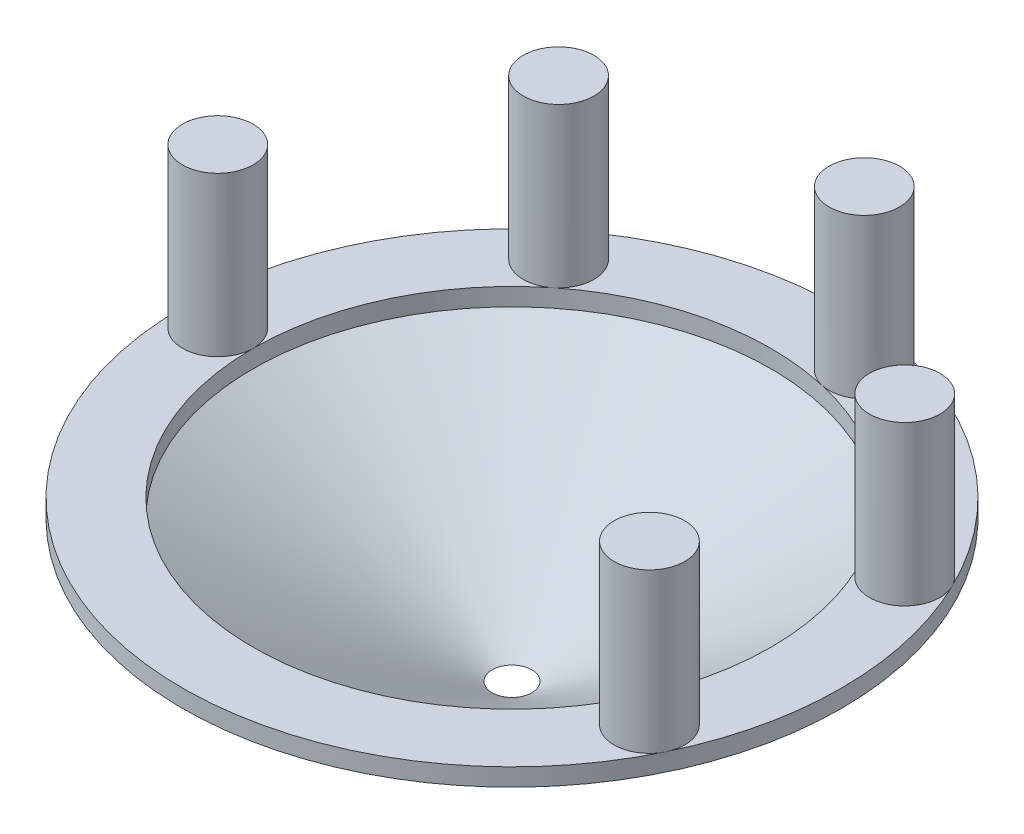
ISO-10303-21;
HEADER;
FILE_DESCRIPTION(('STEP AP214'),'2;1');
FILE_NAME('part.step','',(''),(''),'','','');
FILE_SCHEMA(('AUTOMOTIVE_DESIGN { 1 0 10303 214 1 1 1 1 }'));
ENDSEC;
DATA;
#1=APPLICATION_CONTEXT('core data for automotive mechanical design processes');
#2=APPLICATION_PROTOCOL_DEFINITION('international standard','automotive_design',2000,#1);
#3=PRODUCT_CONTEXT('',#1,'mechanical');
#4=PRODUCT('Part','Part','',(#3));
#5=PRODUCT_RELATED_PRODUCT_CATEGORY('part','',(#4));
#6=PRODUCT_DEFINITION_FORMATION('','',#4);
#7=PRODUCT_DEFINITION_CONTEXT('part definition',#1,'design');
#8=PRODUCT_DEFINITION('design','',#6,#7);
#9=PRODUCT_DEFINITION_SHAPE('','',#8);
#10=(LENGTH_UNIT() NAMED_UNIT(*) SI_UNIT(.MILLI.,.METRE.));
#11=(NAMED_UNIT(*) PLANE_ANGLE_UNIT() SI_UNIT($,.RADIAN.));
#12=(NAMED_UNIT(*) SI_UNIT($,.STERADIAN.) SOLID_ANGLE_UNIT());
#13=UNCERTAINTY_MEASURE_WITH_UNIT(LENGTH_MEASURE(1.E-05),#10,'distance_accuracy_value','');
#14=(GEOMETRIC_REPRESENTATION_CONTEXT(3) GLOBAL_UNCERTAINTY_ASSIGNED_CONTEXT((#13)) GLOBAL_UNIT_ASSIGNED_CONTEXT((#10,
#11,#12)) REPRESENTATION_CONTEXT('',''));
#15=CARTESIAN_POINT('',(0.,0.,0.));
#16=DIRECTION('',(0.,0.,1.));
#17=DIRECTION('',(1.,0.,0.));
#18=AXIS2_PLACEMENT_3D('',#15,#16,#17);
#19=CARTESIAN_POINT('',(22.,1.49999999999999,0.));
#20=DIRECTION('',(0.,1.,0.));
#21=DIRECTION('',(-1.,0.,0.));
#22=AXIS2_PLACEMENT_3D('',#19,#20,#21);
#23=PLANE('',#22);
#24=CARTESIAN_POINT('',(0.,1.49999999999995,0.));
#25=DIRECTION('',(0.,-1.,0.));
#26=DIRECTION('',(1.,0.,0.));
#27=AXIS2_PLACEMENT_3D('',#24,#25,#26);
#28=CIRCLE('',#27,22.);
#29=CARTESIAN_POINT('',(19.8213150938533,1.49999999999999,-9.54544226058617));
#30=VERTEX_POINT('',#29);
#31=CARTESIAN_POINT('',(19.8213150938531,1.50000000000001,9.54544226058644));
#32=VERTEX_POINT('',#31);
#33=EDGE_CURVE('E99',#30,#32,#28,.T.);
#34=ORIENTED_EDGE('',*,*,#33,.T.);
#35=CARTESIAN_POINT('',(22.5242216975604,1.49999999999999,10.8470934779391));
#36=DIRECTION('',(0.,1.,0.));
#37=DIRECTION('',(0.900968867902416,0.,0.433883739117565));
#38=AXIS2_PLACEMENT_3D('',#35,#36,#37);
#39=CIRCLE('',#38,3.);
#40=CARTESIAN_POINT('',(25.2271283012676,1.5,12.1487446952918));
#41=VERTEX_POINT('',#40);
#42=EDGE_CURVE('E54',#32,#41,#39,.F.);
#43=ORIENTED_EDGE('',*,*,#42,.T.);
#44=CARTESIAN_POINT('',(0.,1.49999999999995,0.));
#45=DIRECTION('',(0.,-1.,0.));
#46=DIRECTION('',(1.,0.,0.));
#47=AXIS2_PLACEMENT_3D('',#44,#45,#46);
#48=CIRCLE('',#47,28.);
#49=CARTESIAN_POINT('',(25.2271283012678,1.50000000000003,-12.1487446952915));
#50=VERTEX_POINT('',#49);
#51=EDGE_CURVE('E96',#50,#41,#48,.T.);
#52=ORIENTED_EDGE('',*,*,#51,.F.);
#53=CARTESIAN_POINT('',(22.5242216975605,1.49999999999999,-10.8470934779388));
#54=DIRECTION('',(0.,1.,0.));
#55=DIRECTION('',(0.900968867902422,0.,-0.433883739117553));
#56=AXIS2_PLACEMENT_3D('',#53,#54,#55);
#57=CIRCLE('',#56,3.);
#58=EDGE_CURVE('E61',#50,#30,#57,.F.);
#59=ORIENTED_EDGE('',*,*,#58,.T.);
#60=EDGE_LOOP('',(#34,#43,#52,#59));
#61=FACE_BOUND('',#60,.T.);
#62=ADVANCED_FACE('F39',(#61),#23,.T.);
#63=CARTESIAN_POINT('',(-28.,1.49999999999985,0.));
#64=VERTEX_POINT('',#63);
#65=EDGE_CURVE('E101',#41,#64,#48,.T.);
#66=ORIENTED_EDGE('',*,*,#65,.F.);
#67=EDGE_CURVE('E84',#41,#32,#39,.F.);
#68=ORIENTED_EDGE('',*,*,#67,.T.);
#69=CARTESIAN_POINT('',(-22.,1.49999999999985,0.));
#70=VERTEX_POINT('',#69);
#71=EDGE_CURVE('E48',#32,#70,#28,.T.);
#72=ORIENTED_EDGE('',*,*,#71,.T.);
#73=CARTESIAN_POINT('',(-25.,1.49999999999983,0.));
#74=DIRECTION('',(0.,1.,0.));
#75=DIRECTION('',(-1.,0.,0.));
#76=AXIS2_PLACEMENT_3D('',#73,#74,#75);
#77=CIRCLE('',#76,3.);
#78=EDGE_CURVE('E104',#70,#64,#77,.F.);
#79=ORIENTED_EDGE('',*,*,#78,.T.);
#80=EDGE_LOOP('',(#66,#68,#72,#79));
#81=FACE_BOUND('',#80,.T.);
#82=ADVANCED_FACE('F102',(#81),#23,.T.);
#83=CARTESIAN_POINT('',(4.89546054703897,1.49999999999993,-21.4484140680001));
#84=VERTEX_POINT('',#83);
#85=EDGE_CURVE('E159',#84,#30,#28,.T.);
#86=ORIENTED_EDGE('',*,*,#85,.T.);
#87=EDGE_CURVE('E151',#30,#50,#57,.F.);
#88=ORIENTED_EDGE('',*,*,#87,.T.);
#89=CARTESIAN_POINT('',(6.2305861507769,1.49999999999997,-27.297981541091));
#90=VERTEX_POINT('',#89);
#91=EDGE_CURVE('E114',#90,#50,#48,.T.);
#92=ORIENTED_EDGE('',*,*,#91,.F.);
#93=CARTESIAN_POINT('',(5.56302334890795,1.49999999999994,-24.3731978045456));
#94=DIRECTION('',(0.,1.,0.));
#95=DIRECTION('',(0.222520933956318,0.,-0.974927912181823));
#96=AXIS2_PLACEMENT_3D('',#93,#94,#95);
#97=CIRCLE('',#96,3.);
#98=EDGE_CURVE('E143',#90,#84,#97,.F.);
#99=ORIENTED_EDGE('',*,*,#98,.T.);
#100=EDGE_LOOP('',(#86,#88,#92,#99));
#101=FACE_BOUND('',#100,.T.);
#102=ADVANCED_FACE('F157',(#101),#23,.T.);
#103=CARTESIAN_POINT('',(-13.7167756408921,1.49999999999987,-17.2002926142967));
#104=VERTEX_POINT('',#103);
#105=EDGE_CURVE('E47',#104,#84,#28,.T.);
#106=ORIENTED_EDGE('',*,*,#105,.T.);
#107=EDGE_CURVE('E146',#84,#90,#97,.F.);
#108=ORIENTED_EDGE('',*,*,#107,.T.);
#109=CARTESIAN_POINT('',(-17.4577144520445,1.49999999999989,-21.8912815091049));
#110=VERTEX_POINT('',#109);
#111=EDGE_CURVE('E115',#110,#90,#48,.T.);
#112=ORIENTED_EDGE('',*,*,#111,.F.);
#113=CARTESIAN_POINT('',(-15.5872450464683,1.49999999999986,-19.5457870617008));
#114=DIRECTION('',(0.,1.,0.));
#115=DIRECTION('',(-0.623489801858732,0.,-0.781831482468031));
#116=AXIS2_PLACEMENT_3D('',#113,#114,#115);
#117=CIRCLE('',#116,3.);
#118=EDGE_CURVE('E136',#110,#104,#117,.F.);
#119=ORIENTED_EDGE('',*,*,#118,.T.);
#120=EDGE_LOOP('',(#106,#108,#112,#119));
#121=FACE_BOUND('',#120,.T.);
#122=ADVANCED_FACE('F175',(#121),#23,.T.);
#123=CARTESIAN_POINT('',(1.99793740244693E-12,-582.446756225542,0.));
#124=DIRECTION('',(0.,-1.,0.));
#125=DIRECTION('',(1.,0.,0.));
#126=AXIS2_PLACEMENT_3D('',#123,#124,#125);
#127=CYLINDRICAL_SURFACE('',#126,22.);
#128=CARTESIAN_POINT('',(0.,-1.11022302462516E-13,0.));
#129=DIRECTION('',(0.,-1.,0.));
#130=DIRECTION('',(1.,0.,0.));
#131=AXIS2_PLACEMENT_3D('',#128,#129,#130);
#132=CIRCLE('',#131,22.);
#133=CARTESIAN_POINT('',(22.,0.,0.));
#134=VERTEX_POINT('',#133);
#135=EDGE_CURVE('E125',#134,#134,#132,.T.);
#136=ORIENTED_EDGE('',*,*,#135,.T.);
#137=EDGE_LOOP('',(#136));
#138=FACE_BOUND('',#137,.T.);
#139=EDGE_CURVE('E11',#70,#104,#28,.T.);
#140=ORIENTED_EDGE('',*,*,#139,.F.);
#141=ORIENTED_EDGE('',*,*,#71,.F.);
#142=ORIENTED_EDGE('',*,*,#33,.F.);
#143=ORIENTED_EDGE('',*,*,#85,.F.);
#144=ORIENTED_EDGE('',*,*,#105,.F.);
#145=EDGE_LOOP('',(#140,#141,#142,#143,#144));
#146=FACE_BOUND('',#145,.T.);
#147=ADVANCED_FACE('F41',(#138,#146),#127,.F.);
#148=ORIENTED_EDGE('',*,*,#139,.T.);
#149=EDGE_CURVE('E139',#104,#110,#117,.F.);
#150=ORIENTED_EDGE('',*,*,#149,.T.);
#151=EDGE_CURVE('E110',#64,#110,#48,.T.);
#152=ORIENTED_EDGE('',*,*,#151,.F.);
#153=EDGE_CURVE('E128',#64,#70,#77,.F.);
#154=ORIENTED_EDGE('',*,*,#153,.T.);
#155=EDGE_LOOP('',(#148,#150,#152,#154));
#156=FACE_BOUND('',#155,.T.);
#157=ADVANCED_FACE('F171',(#156),#23,.T.);
#158=CARTESIAN_POINT('',(1.99793740244693E-12,-582.446756225542,0.));
#159=DIRECTION('',(0.,-1.,0.));
#160=DIRECTION('',(1.,0.,0.));
#161=AXIS2_PLACEMENT_3D('',#158,#159,#160);
#162=CYLINDRICAL_SURFACE('',#161,28.);
#163=CARTESIAN_POINT('',(0.,-1.11022302462516E-13,0.));
#164=DIRECTION('',(0.,-1.,0.));
#165=DIRECTION('',(1.,0.,0.));
#166=AXIS2_PLACEMENT_3D('',#163,#164,#165);
#167=CIRCLE('',#166,28.);
#168=CARTESIAN_POINT('',(28.,0.,0.));
#169=VERTEX_POINT('',#168);
#170=EDGE_CURVE('E109',#169,#169,#167,.T.);
#171=ORIENTED_EDGE('',*,*,#170,.F.);
#172=EDGE_LOOP('',(#171));
#173=FACE_BOUND('',#172,.T.);
#174=ORIENTED_EDGE('',*,*,#151,.T.);
#175=ORIENTED_EDGE('',*,*,#111,.T.);
#176=ORIENTED_EDGE('',*,*,#91,.T.);
#177=ORIENTED_EDGE('',*,*,#51,.T.);
#178=ORIENTED_EDGE('',*,*,#65,.T.);
#179=EDGE_LOOP('',(#174,#175,#176,#177,#178));
#180=FACE_BOUND('',#179,.T.);
#181=ADVANCED_FACE('F111',(#173,#180),#162,.T.);
#182=CARTESIAN_POINT('',(0.,-12.,0.));
#183=DIRECTION('',(0.,1.,0.));
#184=DIRECTION('',(-1.,0.,0.));
#185=AXIS2_PLACEMENT_3D('',#182,#183,#184);
#186=CONICAL_SURFACE('',#185,3.17499999999996,1.12052991420768);
#187=ORIENTED_EDGE('',*,*,#170,.T.);
#188=EDGE_LOOP('',(#187));
#189=FACE_BOUND('',#188,.T.);
#190=CARTESIAN_POINT('',(0.,-12.,0.));
#191=DIRECTION('',(0.,-1.,0.));
#192=DIRECTION('',(1.,0.,0.));
#193=AXIS2_PLACEMENT_3D('',#190,#191,#192);
#194=CIRCLE('',#193,3.17499999999996);
#195=CARTESIAN_POINT('',(3.175,-12.,0.));
#196=VERTEX_POINT('',#195);
#197=EDGE_CURVE('E119',#196,#196,#194,.T.);
#198=ORIENTED_EDGE('',*,*,#197,.F.);
#199=EDGE_LOOP('',(#198));
#200=FACE_BOUND('',#199,.T.);
#201=ADVANCED_FACE('F206',(#189,#200),#186,.T.);
#202=CARTESIAN_POINT('',(3.175,-12.,0.));
#203=DIRECTION('',(0.,-1.,0.));
#204=DIRECTION('',(1.,0.,0.));
#205=AXIS2_PLACEMENT_3D('',#202,#203,#204);
#206=PLANE('',#205);
#207=ORIENTED_EDGE('',*,*,#197,.T.);
#208=EDGE_LOOP('',(#207));
#209=FACE_BOUND('',#208,.T.);
#210=CARTESIAN_POINT('',(0.,-12.,0.));
#211=DIRECTION('',(0.,-1.,0.));
#212=DIRECTION('',(1.,0.,0.));
#213=AXIS2_PLACEMENT_3D('',#210,#211,#212);
#214=CIRCLE('',#213,1.68594999999996);
#215=CARTESIAN_POINT('',(1.68595,-12.,0.));
#216=VERTEX_POINT('',#215);
#217=EDGE_CURVE('E122',#216,#216,#214,.T.);
#218=ORIENTED_EDGE('',*,*,#217,.F.);
#219=EDGE_LOOP('',(#218));
#220=FACE_BOUND('',#219,.T.);
#221=ADVANCED_FACE('F305',(#209,#220),#206,.T.);
#222=CARTESIAN_POINT('',(0.,-1.11022302462516E-13,0.));
#223=DIRECTION('',(0.,1.,0.));
#224=DIRECTION('',(-1.,0.,0.));
#225=AXIS2_PLACEMENT_3D('',#222,#223,#224);
#226=CONICAL_SURFACE('',#225,22.,1.0372252204965);
#227=ORIENTED_EDGE('',*,*,#217,.T.);
#228=EDGE_LOOP('',(#227));
#229=FACE_BOUND('',#228,.T.);
#230=ORIENTED_EDGE('',*,*,#135,.F.);
#231=EDGE_LOOP('',(#230));
#232=FACE_BOUND('',#231,.T.);
#233=ADVANCED_FACE('F316',(#229,#232),#226,.F.);
#234=CARTESIAN_POINT('',(-25.,15.,0.));
#235=DIRECTION('',(0.,-1.,0.));
#236=DIRECTION('',(0.,0.,-1.));
#237=AXIS2_PLACEMENT_3D('',#234,#235,#236);
#238=CYLINDRICAL_SURFACE('',#237,3.);
#239=ORIENTED_EDGE('',*,*,#153,.F.);
#240=ORIENTED_EDGE('',*,*,#78,.F.);
#241=EDGE_LOOP('',(#239,#240));
#242=FACE_BOUND('',#241,.T.);
#243=CARTESIAN_POINT('',(-25.,15.,0.));
#244=DIRECTION('',(0.,1.,0.));
#245=DIRECTION('',(0.,0.,1.));
#246=AXIS2_PLACEMENT_3D('',#243,#244,#245);
#247=CIRCLE('',#246,3.);
#248=CARTESIAN_POINT('',(-25.,15.,3.));
#249=VERTEX_POINT('',#248);
#250=EDGE_CURVE('E130',#249,#249,#247,.T.);
#251=ORIENTED_EDGE('',*,*,#250,.F.);
#252=EDGE_LOOP('',(#251));
#253=FACE_BOUND('',#252,.T.);
#254=ADVANCED_FACE('F168',(#242,#253),#238,.T.);
#255=CARTESIAN_POINT('',(-25.,15.,0.));
#256=DIRECTION('',(0.,1.,0.));
#257=DIRECTION('',(0.,0.,1.));
#258=AXIS2_PLACEMENT_3D('',#255,#256,#257);
#259=PLANE('',#258);
#260=ORIENTED_EDGE('',*,*,#250,.T.);
#261=EDGE_LOOP('',(#260));
#262=FACE_BOUND('',#261,.T.);
#263=ADVANCED_FACE('F182',(#262),#259,.T.);
#264=CARTESIAN_POINT('',(-15.5872450464683,15.,-19.5457870617007));
#265=DIRECTION('',(0.,-1.,0.));
#266=DIRECTION('',(0.781831482468031,0.,-0.623489801858732));
#267=AXIS2_PLACEMENT_3D('',#264,#265,#266);
#268=CYLINDRICAL_SURFACE('',#267,3.);
#269=ORIENTED_EDGE('',*,*,#118,.F.);
#270=ORIENTED_EDGE('',*,*,#149,.F.);
#271=EDGE_LOOP('',(#269,#270));
#272=FACE_BOUND('',#271,.T.);
#273=CARTESIAN_POINT('',(-15.5872450464683,15.,-19.5457870617007));
#274=DIRECTION('',(0.,1.,0.));
#275=DIRECTION('',(-0.781831482468031,0.,0.623489801858732));
#276=AXIS2_PLACEMENT_3D('',#273,#274,#275);
#277=CIRCLE('',#276,3.);
#278=CARTESIAN_POINT('',(-17.9327394938724,15.,-17.6753176561245));
#279=VERTEX_POINT('',#278);
#280=EDGE_CURVE('E133',#279,#279,#277,.T.);
#281=ORIENTED_EDGE('',*,*,#280,.F.);
#282=EDGE_LOOP('',(#281));
#283=FACE_BOUND('',#282,.T.);
#284=ADVANCED_FACE('F178',(#272,#283),#268,.T.);
#285=CARTESIAN_POINT('',(-15.5872450464683,15.,-19.5457870617007));
#286=DIRECTION('',(0.,1.,0.));
#287=DIRECTION('',(-0.781831482468031,0.,0.623489801858732));
#288=AXIS2_PLACEMENT_3D('',#285,#286,#287);
#289=PLANE('',#288);
#290=ORIENTED_EDGE('',*,*,#280,.T.);
#291=EDGE_LOOP('',(#290));
#292=FACE_BOUND('',#291,.T.);
#293=ADVANCED_FACE('F181',(#292),#289,.T.);
#294=CARTESIAN_POINT('',(5.56302334890789,15.0000000000001,-24.3731978045455));
#295=DIRECTION('',(0.,-1.,0.));
#296=DIRECTION('',(0.974927912181823,0.,0.222520933956318));
#297=AXIS2_PLACEMENT_3D('',#294,#295,#296);
#298=CYLINDRICAL_SURFACE('',#297,3.);
#299=ORIENTED_EDGE('',*,*,#98,.F.);
#300=ORIENTED_EDGE('',*,*,#107,.F.);
#301=EDGE_LOOP('',(#299,#300));
#302=FACE_BOUND('',#301,.T.);
#303=CARTESIAN_POINT('',(5.56302334890789,15.0000000000001,-24.3731978045455));
#304=DIRECTION('',(0.,1.,0.));
#305=DIRECTION('',(-0.974927912181823,0.,-0.222520933956318));
#306=AXIS2_PLACEMENT_3D('',#303,#304,#305);
#307=CIRCLE('',#306,3.);
#308=CARTESIAN_POINT('',(2.63823961236243,15.0000000000001,-25.0407606064145));
#309=VERTEX_POINT('',#308);
#310=EDGE_CURVE('E140',#309,#309,#307,.T.);
#311=ORIENTED_EDGE('',*,*,#310,.F.);
#312=EDGE_LOOP('',(#311));
#313=FACE_BOUND('',#312,.T.);
#314=ADVANCED_FACE('F187',(#302,#313),#298,.T.);
#315=CARTESIAN_POINT('',(5.56302334890789,15.0000000000001,-24.3731978045455));
#316=DIRECTION('',(0.,1.,0.));
#317=DIRECTION('',(-0.974927912181823,0.,-0.222520933956318));
#318=AXIS2_PLACEMENT_3D('',#315,#316,#317);
#319=PLANE('',#318);
#320=ORIENTED_EDGE('',*,*,#310,.T.);
#321=EDGE_LOOP('',(#320));
#322=FACE_BOUND('',#321,.T.);
#323=ADVANCED_FACE('F192',(#322),#319,.T.);
#324=CARTESIAN_POINT('',(22.5242216975604,15.0000000000002,-10.8470934779388));
#325=DIRECTION('',(0.,-1.,0.));
#326=DIRECTION('',(0.433883739117553,0.,0.900968867902422));
#327=AXIS2_PLACEMENT_3D('',#324,#325,#326);
#328=CYLINDRICAL_SURFACE('',#327,3.);
#329=ORIENTED_EDGE('',*,*,#58,.F.);
#330=ORIENTED_EDGE('',*,*,#87,.F.);
#331=EDGE_LOOP('',(#329,#330));
#332=FACE_BOUND('',#331,.T.);
#333=CARTESIAN_POINT('',(22.5242216975604,15.0000000000002,-10.8470934779388));
#334=DIRECTION('',(0.,1.,0.));
#335=DIRECTION('',(-0.433883739117553,0.,-0.900968867902422));
#336=AXIS2_PLACEMENT_3D('',#333,#334,#335);
#337=CIRCLE('',#336,3.);
#338=CARTESIAN_POINT('',(21.2225704802078,15.0000000000002,-13.5500000816461));
#339=VERTEX_POINT('',#338);
#340=EDGE_CURVE('E147',#339,#339,#337,.T.);
#341=ORIENTED_EDGE('',*,*,#340,.F.);
#342=EDGE_LOOP('',(#341));
#343=FACE_BOUND('',#342,.T.);
#344=ADVANCED_FACE('F160',(#332,#343),#328,.T.);
#345=CARTESIAN_POINT('',(22.5242216975604,15.0000000000002,-10.8470934779388));
#346=DIRECTION('',(0.,1.,0.));
#347=DIRECTION('',(-0.433883739117553,0.,-0.900968867902422));
#348=AXIS2_PLACEMENT_3D('',#345,#346,#347);
#349=PLANE('',#348);
#350=ORIENTED_EDGE('',*,*,#340,.T.);
#351=EDGE_LOOP('',(#350));
#352=FACE_BOUND('',#351,.T.);
#353=ADVANCED_FACE('F234',(#352),#349,.T.);
#354=CARTESIAN_POINT('',(22.5242216975603,15.0000000000002,10.8470934779391));
#355=DIRECTION('',(0.,-1.,0.));
#356=DIRECTION('',(-0.433883739117565,0.,0.900968867902416));
#357=AXIS2_PLACEMENT_3D('',#354,#355,#356);
#358=CYLINDRICAL_SURFACE('',#357,3.);
#359=ORIENTED_EDGE('',*,*,#67,.F.);
#360=ORIENTED_EDGE('',*,*,#42,.F.);
#361=EDGE_LOOP('',(#359,#360));
#362=FACE_BOUND('',#361,.T.);
#363=CARTESIAN_POINT('',(22.5242216975603,15.0000000000002,10.8470934779391));
#364=DIRECTION('',(0.,1.,0.));
#365=DIRECTION('',(0.433883739117565,0.,-0.900968867902416));
#366=AXIS2_PLACEMENT_3D('',#363,#364,#365);
#367=CIRCLE('',#366,3.);
#368=CARTESIAN_POINT('',(23.825872914913,15.0000000000002,8.14418687423186));
#369=VERTEX_POINT('',#368);
#370=EDGE_CURVE('E90',#369,#369,#367,.T.);
#371=ORIENTED_EDGE('',*,*,#370,.F.);
#372=EDGE_LOOP('',(#371));
#373=FACE_BOUND('',#372,.T.);
#374=ADVANCED_FACE('F85',(#362,#373),#358,.T.);
#375=CARTESIAN_POINT('',(22.5242216975603,15.0000000000002,10.8470934779391));
#376=DIRECTION('',(0.,1.,0.));
#377=DIRECTION('',(0.433883739117565,0.,-0.900968867902416));
#378=AXIS2_PLACEMENT_3D('',#375,#376,#377);
#379=PLANE('',#378);
#380=ORIENTED_EDGE('',*,*,#370,.T.);
#381=EDGE_LOOP('',(#380));
#382=FACE_BOUND('',#381,.T.);
#383=ADVANCED_FACE('F255',(#382),#379,.T.);
#384=CLOSED_SHELL('',(#62,#82,#102,#122,#147,#157,#181,#201,#221,#233,#254,#263,#284,#293,#314,
#323,#344,#353,#374,#383));
#385=MANIFOLD_SOLID_BREP('B2',#384);
#386=ADVANCED_BREP_SHAPE_REPRESENTATION('',(#18,#385),#14);
#387=SHAPE_DEFINITION_REPRESENTATION(#9,#386);
ENDSEC;
END-ISO-10303-21;
